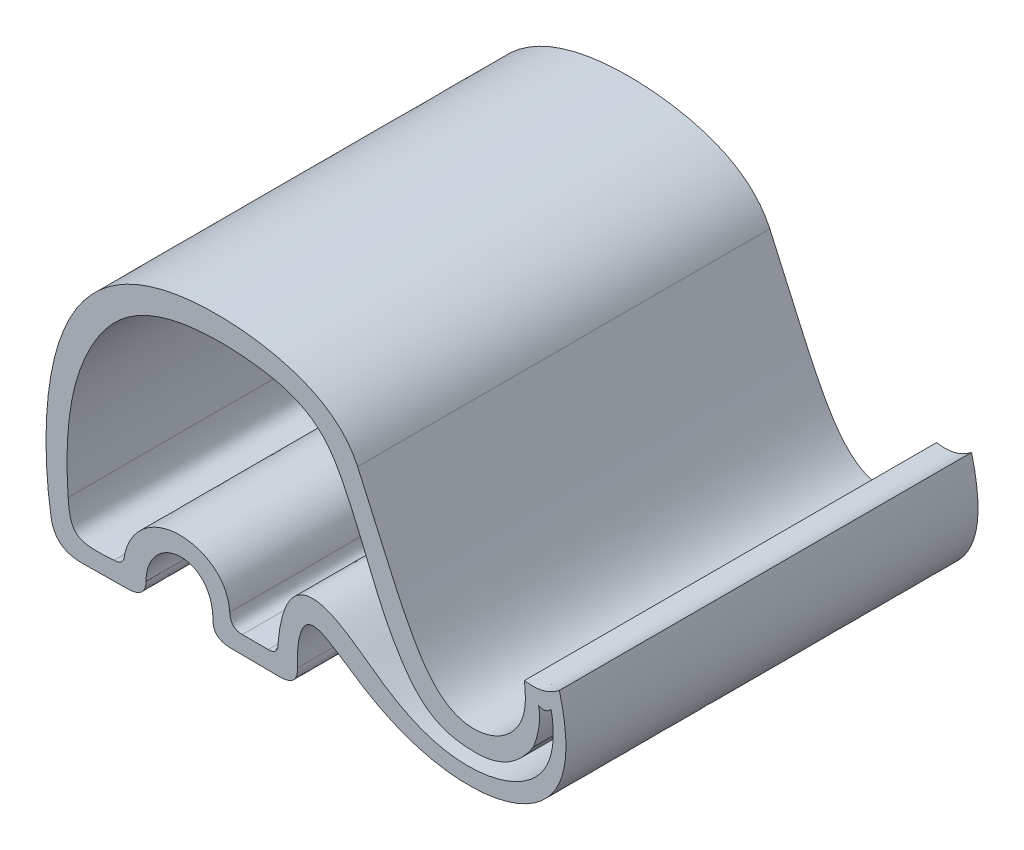
ISO-10303-21;
HEADER;
FILE_DESCRIPTION(('STEP AP214'),'2;1');
FILE_NAME('part.step','',(''),(''),'','','');
FILE_SCHEMA(('AUTOMOTIVE_DESIGN { 1 0 10303 214 1 1 1 1 }'));
ENDSEC;
DATA;
#1=APPLICATION_CONTEXT('core data for automotive mechanical design processes');
#2=APPLICATION_PROTOCOL_DEFINITION('international standard','automotive_design',2000,#1);
#3=PRODUCT_CONTEXT('',#1,'mechanical');
#4=PRODUCT('Part','Part','',(#3));
#5=PRODUCT_RELATED_PRODUCT_CATEGORY('part','',(#4));
#6=PRODUCT_DEFINITION_FORMATION('','',#4);
#7=PRODUCT_DEFINITION_CONTEXT('part definition',#1,'design');
#8=PRODUCT_DEFINITION('design','',#6,#7);
#9=PRODUCT_DEFINITION_SHAPE('','',#8);
#10=(LENGTH_UNIT() NAMED_UNIT(*) SI_UNIT(.MILLI.,.METRE.));
#11=(NAMED_UNIT(*) PLANE_ANGLE_UNIT() SI_UNIT($,.RADIAN.));
#12=(NAMED_UNIT(*) SI_UNIT($,.STERADIAN.) SOLID_ANGLE_UNIT());
#13=UNCERTAINTY_MEASURE_WITH_UNIT(LENGTH_MEASURE(1.E-05),#10,'distance_accuracy_value','');
#14=(GEOMETRIC_REPRESENTATION_CONTEXT(3) GLOBAL_UNCERTAINTY_ASSIGNED_CONTEXT((#13)) GLOBAL_UNIT_ASSIGNED_CONTEXT((#10,
#11,#12)) REPRESENTATION_CONTEXT('',''));
#15=CARTESIAN_POINT('',(0.,0.,0.));
#16=DIRECTION('',(0.,0.,1.));
#17=DIRECTION('',(1.,0.,0.));
#18=AXIS2_PLACEMENT_3D('',#15,#16,#17);
#19=CARTESIAN_POINT('',(-18.1297541734926,-1.68453041639156,60.));
#20=DIRECTION('',(0.,0.,-1.));
#21=DIRECTION('',(-1.,0.,0.));
#22=AXIS2_PLACEMENT_3D('',#19,#20,#21);
#23=PLANE('',#22);
#24=CARTESIAN_POINT('',(-18.7847093074648,0.025033472230253,60.));
#25=CARTESIAN_POINT('',(-18.8048831771839,-2.25438504593217,60.));
#26=CARTESIAN_POINT('',(-16.1245410321378,-2.25438504593217,60.));
#27=B_SPLINE_CURVE_WITH_KNOTS('',2,(#24,#25,#26),.UNSPECIFIED.,.F.,.F.,(3,3),(0.,1.),.UNSPECIFIED.);
#28=CARTESIAN_POINT('',(-18.7847093074648,0.025033472230253,60.));
#29=VERTEX_POINT('',#28);
#30=CARTESIAN_POINT('',(-16.1245410321378,-2.25438504593217,60.));
#31=VERTEX_POINT('',#30);
#32=EDGE_CURVE('E377',#29,#31,#27,.T.);
#33=ORIENTED_EDGE('',*,*,#32,.T.);
#34=DIRECTION('',(0.999963075438187,-0.00859347195278756,0.));
#35=VECTOR('',#34,1.);
#36=CARTESIAN_POINT('',(-16.1245410321378,-2.25438504593217,60.));
#37=LINE('',#36,#35);
#38=CARTESIAN_POINT('',(-9.13720622140498,-2.31443272888732,60.));
#39=VERTEX_POINT('',#38);
#40=EDGE_CURVE('E382',#31,#39,#37,.T.);
#41=ORIENTED_EDGE('',*,*,#40,.T.);
#42=CARTESIAN_POINT('',(-9.13720622140498,-2.31443272888732,60.));
#43=CARTESIAN_POINT('',(-6.35499691114976,-2.31443272888732,60.));
#44=CARTESIAN_POINT('',(-6.49510817137844,0.0874745893186231,60.));
#45=B_SPLINE_CURVE_WITH_KNOTS('',2,(#42,#43,#44),.UNSPECIFIED.,.F.,.F.,(3,3),(0.,1.),.UNSPECIFIED.);
#46=CARTESIAN_POINT('',(-6.49510817137844,0.0874745893186231,60.));
#47=VERTEX_POINT('',#46);
#48=EDGE_CURVE('E306',#39,#47,#45,.T.);
#49=ORIENTED_EDGE('',*,*,#48,.T.);
#50=CARTESIAN_POINT('',(-6.49510817137844,0.0874745893186231,60.));
#51=CARTESIAN_POINT('',(-6.72723372543326,7.79426015378786,60.));
#52=CARTESIAN_POINT('',(-4.30537033496014,9.55683443487067,60.));
#53=CARTESIAN_POINT('',(-1.85681080800865,8.18270365939022,60.));
#54=CARTESIAN_POINT('',(4.00268060893978,-2.09376082659216,60.));
#55=CARTESIAN_POINT('',(8.25644528516201,-4.78556569229704,60.));
#56=CARTESIAN_POINT('',(28.1896617064245,-6.26321452192812,60.));
#57=CARTESIAN_POINT('',(36.1608229452765,-1.24680260852348,60.));
#58=CARTESIAN_POINT('',(31.6514175632646,16.3395533054302,60.));
#59=B_SPLINE_CURVE_WITH_KNOTS('',8,(#50,#51,#52,#53,#54,#55,#56,#57,#58),.UNSPECIFIED.,.F.,.F.,
(9,9),(0.,1.),.UNSPECIFIED.);
#60=CARTESIAN_POINT('',(31.6514175632646,16.3395533054302,60.));
#61=VERTEX_POINT('',#60);
#62=EDGE_CURVE('E400',#47,#61,#59,.T.);
#63=ORIENTED_EDGE('',*,*,#62,.T.);
#64=CARTESIAN_POINT('',(31.6514175632646,16.3395533054302,60.));
#65=CARTESIAN_POINT('',(29.3835241252475,14.5408791994166,60.));
#66=CARTESIAN_POINT('',(26.5709547271854,15.0492001424205,60.));
#67=B_SPLINE_CURVE_WITH_KNOTS('',2,(#64,#65,#66),.UNSPECIFIED.,.F.,.F.,(3,3),(0.,1.),.UNSPECIFIED.);
#68=CARTESIAN_POINT('',(26.5709547271854,15.0492001424205,60.));
#69=VERTEX_POINT('',#68);
#70=EDGE_CURVE('E478',#61,#69,#67,.T.);
#71=ORIENTED_EDGE('',*,*,#70,.T.);
#72=CARTESIAN_POINT('',(26.5709547271854,15.0492001424205,60.));
#73=CARTESIAN_POINT('',(26.5709547271854,13.3569734216087,60.));
#74=CARTESIAN_POINT('',(27.5193951495443,10.3938462904723,60.));
#75=CARTESIAN_POINT('',(27.2732383145058,3.75339101211778,60.));
#76=CARTESIAN_POINT('',(17.938870985411,2.72399748377636,60.));
#77=CARTESIAN_POINT('',(12.7102260595019,3.67068189153078,60.));
#78=CARTESIAN_POINT('',(12.4464848708059,7.46392132549539,60.));
#79=CARTESIAN_POINT('',(2.27954642313074,29.8588258984784,60.));
#80=B_SPLINE_CURVE_WITH_KNOTS('',7,(#72,#73,#74,#75,#76,#77,#78,#79),.UNSPECIFIED.,.F.,.F.,(8,
8),(0.,1.),.UNSPECIFIED.);
#81=CARTESIAN_POINT('',(2.27954642313074,29.8588258984784,60.));
#82=VERTEX_POINT('',#81);
#83=EDGE_CURVE('E473',#69,#82,#80,.T.);
#84=ORIENTED_EDGE('',*,*,#83,.T.);
#85=CARTESIAN_POINT('',(2.27954642313074,29.8588258984784,60.));
#86=CARTESIAN_POINT('',(-2.55034539516275,40.3668261291284,60.));
#87=CARTESIAN_POINT('',(-16.5827857486711,39.2143749456407,60.));
#88=CARTESIAN_POINT('',(-24.8366252215099,40.440832656324,60.));
#89=CARTESIAN_POINT('',(-37.4297572223647,39.7507980261401,60.));
#90=CARTESIAN_POINT('',(-43.9850862091111,32.160417094118,60.));
#91=CARTESIAN_POINT('',(-44.1810862682469,12.3200787294162,60.));
#92=CARTESIAN_POINT('',(-42.3848689360867,1.43850497539512,60.));
#93=B_SPLINE_CURVE_WITH_KNOTS('',7,(#85,#86,#87,#88,#89,#90,#91,#92),.UNSPECIFIED.,.F.,.F.,(8,
8),(0.,1.),.UNSPECIFIED.);
#94=CARTESIAN_POINT('',(-42.3848689360867,1.43850497539512,60.));
#95=VERTEX_POINT('',#94);
#96=EDGE_CURVE('E451',#82,#95,#93,.T.);
#97=ORIENTED_EDGE('',*,*,#96,.T.);
#98=CARTESIAN_POINT('',(-42.3848689360867,1.43850497539512,60.));
#99=CARTESIAN_POINT('',(-41.9350741180409,-2.36206113870143,60.));
#100=CARTESIAN_POINT('',(-37.8701677236094,-2.36206113870143,60.));
#101=B_SPLINE_CURVE_WITH_KNOTS('',2,(#98,#99,#100),.UNSPECIFIED.,.F.,.F.,(3,3),(0.,1.),.UNSPECIFIED.);
#102=CARTESIAN_POINT('',(-37.8701677236094,-2.36206113870143,60.));
#103=VERTEX_POINT('',#102);
#104=EDGE_CURVE('E445',#95,#103,#101,.T.);
#105=ORIENTED_EDGE('',*,*,#104,.T.);
#106=DIRECTION('',(0.99993930020423,0.0110179810797571,0.));
#107=VECTOR('',#106,1.);
#108=CARTESIAN_POINT('',(-37.8701677236094,-2.36206113870143,60.));
#109=LINE('',#108,#107);
#110=CARTESIAN_POINT('',(-31.2920848975455,-2.28957954696497,60.));
#111=VERTEX_POINT('',#110);
#112=EDGE_CURVE('E439',#103,#111,#109,.T.);
#113=ORIENTED_EDGE('',*,*,#112,.T.);
#114=CARTESIAN_POINT('',(-31.2920848975455,-2.28957954696497,60.));
#115=CARTESIAN_POINT('',(-28.5839041330619,-2.3016734459421,60.));
#116=CARTESIAN_POINT('',(-28.5027158596157,0.0250334721873581,60.));
#117=B_SPLINE_CURVE_WITH_KNOTS('',2,(#114,#115,#116),.UNSPECIFIED.,.F.,.F.,(3,3),(0.,1.),.UNSPECIFIED.);
#118=CARTESIAN_POINT('',(-28.5027158596157,0.0250334721873581,60.));
#119=VERTEX_POINT('',#118);
#120=EDGE_CURVE('E430',#111,#119,#117,.T.);
#121=ORIENTED_EDGE('',*,*,#120,.T.);
#122=CARTESIAN_POINT('',(-28.5027158596157,0.0250334721873581,60.));
#123=CARTESIAN_POINT('',(-28.5035281304003,0.0253063789571861,60.));
#124=CARTESIAN_POINT('',(-29.0299720429813,6.01073130119566,60.));
#125=CARTESIAN_POINT('',(-24.0443593776686,7.08702638996528,60.));
#126=CARTESIAN_POINT('',(-20.7151082196556,6.54751959209084,60.));
#127=CARTESIAN_POINT('',(-18.8345781498626,3.87607070482394,60.));
#128=CARTESIAN_POINT('',(-18.7847093074648,0.025033472230253,60.));
#129=B_SPLINE_CURVE_WITH_KNOTS('',6,(#122,#123,#124,#125,#126,#127,#128),.UNSPECIFIED.,.F.,.F.,
(7,7),(0.,1.),.UNSPECIFIED.);
#130=EDGE_CURVE('E266',#119,#29,#129,.T.);
#131=ORIENTED_EDGE('',*,*,#130,.T.);
#132=EDGE_LOOP('',(#33,#41,#49,#63,#71,#84,#97,#105,#113,#121,#131));
#133=FACE_BOUND('',#132,.T.);
#134=CARTESIAN_POINT('',(-39.8633433420793,4.91544629700078,60.));
#135=CARTESIAN_POINT('',(-39.7384353496423,1.420627816904,60.));
#136=CARTESIAN_POINT('',(-38.7726447975183,0.781301676765599,60.));
#137=CARTESIAN_POINT('',(-38.3703683376246,0.397699779148166,60.));
#138=CARTESIAN_POINT('',(-36.9677710019108,-0.0370483140077449,60.));
#139=CARTESIAN_POINT('',(-33.1623861284738,0.345993029003945,60.));
#140=B_SPLINE_CURVE_WITH_KNOTS('',5,(#134,#135,#136,#137,#138,#139),.UNSPECIFIED.,.F.,.F.,(6,6),
(0.,1.),.UNSPECIFIED.);
#141=CARTESIAN_POINT('',(-39.8633433420793,4.91544629700078,60.));
#142=VERTEX_POINT('',#141);
#143=CARTESIAN_POINT('',(-33.1623861284738,0.345993029003945,60.));
#144=VERTEX_POINT('',#143);
#145=EDGE_CURVE('E184',#142,#144,#140,.T.);
#146=ORIENTED_EDGE('',*,*,#145,.F.);
#147=CARTESIAN_POINT('',(27.8560778192591,7.29140288896654,60.));
#148=CARTESIAN_POINT('',(25.6056802658863,3.81059925901845,60.));
#149=CARTESIAN_POINT('',(22.4450541070152,2.40625153185478,60.));
#150=CARTESIAN_POINT('',(17.0525106645951,2.37024332132425,60.));
#151=CARTESIAN_POINT('',(12.3221203391429,3.17845933394773,60.));
#152=CARTESIAN_POINT('',(7.11186355051298,10.8292700357513,60.));
#153=CARTESIAN_POINT('',(2.93304862444204,20.3605110149802,60.));
#154=CARTESIAN_POINT('',(-0.276148892102618,28.8048724957563,60.));
#155=CARTESIAN_POINT('',(-5.57094018583488,33.9364473003574,60.));
#156=CARTESIAN_POINT('',(-12.8493700722214,35.7048751446622,60.));
#157=CARTESIAN_POINT('',(-24.1392800174855,35.7290492578488,60.));
#158=CARTESIAN_POINT('',(-33.288801860584,31.694286548927,60.));
#159=CARTESIAN_POINT('',(-40.1871586294512,19.4872216189637,60.));
#160=CARTESIAN_POINT('',(-40.2013383317951,9.77162579850276,60.));
#161=CARTESIAN_POINT('',(-39.8633433420793,4.91544629700078,60.));
#162=B_SPLINE_CURVE_WITH_KNOTS('',3,(#147,#148,#149,#150,#151,#152,#153,#154,#155,#156,#157,
#158,#159,#160,#161),.UNSPECIFIED.,.F.,.F.,(4,1,1,1,1,1,1,1,1,1,1,1,4),(0.,0.0675261876122288,
0.0817356603650359,0.142094727528071,0.173477252161881,0.213936971443808,0.323719259612393,
0.348411043133253,0.460854806652413,0.586954776188091,0.706052673818982,0.812362495942945,1.),.UNSPECIFIED.);
#163=CARTESIAN_POINT('',(27.8560778192591,7.29140288896654,60.));
#164=VERTEX_POINT('',#163);
#165=EDGE_CURVE('E682',#164,#142,#162,.T.);
#166=ORIENTED_EDGE('',*,*,#165,.F.);
#167=CARTESIAN_POINT('',(28.6046312849192,12.92466157004,60.));
#168=CARTESIAN_POINT('',(28.9113255295663,11.8785185981307,60.));
#169=CARTESIAN_POINT('',(28.8914869425778,9.9923592917523,60.));
#170=CARTESIAN_POINT('',(27.856077819259,7.29140288896642,60.));
#171=B_SPLINE_CURVE_WITH_KNOTS('',3,(#167,#168,#169,#170),.UNSPECIFIED.,.F.,.F.,(4,4),(0.,1.),.UNSPECIFIED.);
#172=CARTESIAN_POINT('',(28.6046312849192,12.92466157004,60.));
#173=VERTEX_POINT('',#172);
#174=EDGE_CURVE('E688',#173,#164,#171,.T.);
#175=ORIENTED_EDGE('',*,*,#174,.F.);
#176=CARTESIAN_POINT('',(30.4392676222554,13.3569734216087,60.));
#177=CARTESIAN_POINT('',(29.6742811934181,12.4069404229043,60.));
#178=CARTESIAN_POINT('',(28.6046312849192,12.92466157004,60.));
#179=B_SPLINE_CURVE_WITH_KNOTS('',2,(#176,#177,#178),.UNSPECIFIED.,.F.,.F.,(3,3),(0.,1.),.UNSPECIFIED.);
#180=CARTESIAN_POINT('',(30.4392676222554,13.3569734216087,60.));
#181=VERTEX_POINT('',#180);
#182=EDGE_CURVE('E805',#181,#173,#179,.T.);
#183=ORIENTED_EDGE('',*,*,#182,.F.);
#184=CARTESIAN_POINT('',(-9.29300105561001,1.89826092896259,60.));
#185=CARTESIAN_POINT('',(-9.07155049822039,4.66823358767532,60.));
#186=CARTESIAN_POINT('',(-8.60838454863201,6.31111913420722,60.));
#187=CARTESIAN_POINT('',(-7.87672485307844,10.2469340531362,60.));
#188=CARTESIAN_POINT('',(-6.12503309978417,11.5148389621331,60.));
#189=CARTESIAN_POINT('',(-4.7248261426156,13.2523810579135,60.));
#190=CARTESIAN_POINT('',(1.11662821361413,11.538873103432,60.));
#191=CARTESIAN_POINT('',(5.87460045359611,5.99613340565192,60.));
#192=CARTESIAN_POINT('',(5.29823091099882,-0.210652764812113,60.));
#193=CARTESIAN_POINT('',(8.94813075450834,-1.89591269747759,60.));
#194=CARTESIAN_POINT('',(20.6238039031241,-4.10150901676976,60.));
#195=CARTESIAN_POINT('',(29.6197905104313,-0.447897883656895,60.));
#196=CARTESIAN_POINT('',(30.1655563452534,3.59242811933387,60.));
#197=CARTESIAN_POINT('',(31.573214341264,8.28462143936933,60.));
#198=CARTESIAN_POINT('',(30.4392676222554,13.3569734216087,60.));
#199=B_SPLINE_CURVE_WITH_KNOTS('',14,(#184,#185,#186,#187,#188,#189,#190,#191,#192,#193,#194,
#195,#196,#197,#198),.UNSPECIFIED.,.F.,.F.,(15,15),(0.,1.),.UNSPECIFIED.);
#200=CARTESIAN_POINT('',(-9.29300105561001,1.89826092896259,60.));
#201=VERTEX_POINT('',#200);
#202=EDGE_CURVE('E809',#201,#181,#199,.T.);
#203=ORIENTED_EDGE('',*,*,#202,.F.);
#204=CARTESIAN_POINT('',(-10.7385645410521,0.296826767368485,60.));
#205=CARTESIAN_POINT('',(-9.26271249145846,0.266184780041518,60.));
#206=CARTESIAN_POINT('',(-9.29300105561001,1.89826092896259,60.));
#207=B_SPLINE_CURVE_WITH_KNOTS('',2,(#204,#205,#206),.UNSPECIFIED.,.F.,.F.,(3,3),(0.,1.),.UNSPECIFIED.);
#208=CARTESIAN_POINT('',(-10.7385645410521,0.296826767368485,60.));
#209=VERTEX_POINT('',#208);
#210=EDGE_CURVE('E812',#209,#201,#207,.T.);
#211=ORIENTED_EDGE('',*,*,#210,.F.);
#212=DIRECTION('',(1.,0.,0.));
#213=VECTOR('',#212,1.);
#214=CARTESIAN_POINT('',(-14.5104683109225,0.296826767368485,60.));
#215=LINE('',#214,#213);
#216=CARTESIAN_POINT('',(-14.5104683109225,0.296826767368485,60.));
#217=VERTEX_POINT('',#216);
#218=EDGE_CURVE('E829',#217,#209,#215,.T.);
#219=ORIENTED_EDGE('',*,*,#218,.F.);
#220=CARTESIAN_POINT('',(-16.3446685038147,2.19923724161591,60.));
#221=CARTESIAN_POINT('',(-16.226273329023,0.286962920137912,60.));
#222=CARTESIAN_POINT('',(-14.5104683109225,0.296826767368485,60.));
#223=B_SPLINE_CURVE_WITH_KNOTS('',2,(#220,#221,#222),.UNSPECIFIED.,.F.,.F.,(3,3),(0.,1.),.UNSPECIFIED.);
#224=CARTESIAN_POINT('',(-16.3446685038147,2.19923724161591,60.));
#225=VERTEX_POINT('',#224);
#226=EDGE_CURVE('E211',#225,#217,#223,.T.);
#227=ORIENTED_EDGE('',*,*,#226,.F.);
#228=CARTESIAN_POINT('',(-31.6471540702569,1.9177995715692,60.));
#229=CARTESIAN_POINT('',(-30.0566210515396,8.06288287383961,60.));
#230=CARTESIAN_POINT('',(-24.4550019118859,10.4628641969819,60.));
#231=CARTESIAN_POINT('',(-18.2271733326345,8.51850232927837,60.));
#232=CARTESIAN_POINT('',(-16.6176199929895,5.43172208944781,60.));
#233=CARTESIAN_POINT('',(-16.3446685038147,2.19923724161591,60.));
#234=B_SPLINE_CURVE_WITH_KNOTS('',5,(#228,#229,#230,#231,#232,#233),.UNSPECIFIED.,.F.,.F.,(6,6),
(0.,1.),.UNSPECIFIED.);
#235=CARTESIAN_POINT('',(-31.6471540702569,1.9177995715692,60.));
#236=VERTEX_POINT('',#235);
#237=EDGE_CURVE('E207',#236,#225,#234,.T.);
#238=ORIENTED_EDGE('',*,*,#237,.F.);
#239=CARTESIAN_POINT('',(-33.1623861284738,0.345993029003945,60.));
#240=CARTESIAN_POINT('',(-31.6940141905696,0.343791118965749,60.));
#241=CARTESIAN_POINT('',(-31.6471540702569,1.9177995715692,60.));
#242=B_SPLINE_CURVE_WITH_KNOTS('',2,(#239,#240,#241),.UNSPECIFIED.,.F.,.F.,(3,3),(0.,1.),.UNSPECIFIED.);
#243=EDGE_CURVE('E193',#144,#236,#242,.T.);
#244=ORIENTED_EDGE('',*,*,#243,.F.);
#245=EDGE_LOOP('',(#146,#166,#175,#183,#203,#211,#219,#227,#238,#244));
#246=FACE_BOUND('',#245,.T.);
#247=ADVANCED_FACE('F39',(#133,#246),#23,.F.);
#248=CARTESIAN_POINT('',(-18.1297541734926,-1.68453041639156,0.));
#249=DIRECTION('',(0.,0.,-1.));
#250=DIRECTION('',(-1.,0.,0.));
#251=AXIS2_PLACEMENT_3D('',#248,#249,#250);
#252=PLANE('',#251);
#253=CARTESIAN_POINT('',(-18.7847093074648,0.025033472230253,0.));
#254=CARTESIAN_POINT('',(-18.8048831771839,-2.25438504593217,0.));
#255=CARTESIAN_POINT('',(-16.1245410321378,-2.25438504593217,0.));
#256=B_SPLINE_CURVE_WITH_KNOTS('',2,(#253,#254,#255),.UNSPECIFIED.,.F.,.F.,(3,3),(0.,1.),.UNSPECIFIED.);
#257=CARTESIAN_POINT('',(-18.7847093074648,0.025033472230253,0.));
#258=VERTEX_POINT('',#257);
#259=CARTESIAN_POINT('',(-16.1245410321378,-2.25438504593217,0.));
#260=VERTEX_POINT('',#259);
#261=EDGE_CURVE('E202',#258,#260,#256,.T.);
#262=ORIENTED_EDGE('',*,*,#261,.F.);
#263=CARTESIAN_POINT('',(-28.5027158596157,0.0250334721873581,0.));
#264=CARTESIAN_POINT('',(-28.5035281304003,0.0253063789571861,0.));
#265=CARTESIAN_POINT('',(-29.0299720429813,6.01073130119566,0.));
#266=CARTESIAN_POINT('',(-24.0443593776686,7.08702638996528,0.));
#267=CARTESIAN_POINT('',(-20.7151082196556,6.54751959209084,0.));
#268=CARTESIAN_POINT('',(-18.8345781498626,3.87607070482394,0.));
#269=CARTESIAN_POINT('',(-18.7847093074648,0.025033472230253,0.));
#270=B_SPLINE_CURVE_WITH_KNOTS('',6,(#263,#264,#265,#266,#267,#268,#269),.UNSPECIFIED.,.F.,.F.,
(7,7),(0.,1.),.UNSPECIFIED.);
#271=CARTESIAN_POINT('',(-28.5027158596157,0.0250334721873581,0.));
#272=VERTEX_POINT('',#271);
#273=EDGE_CURVE('E254',#272,#258,#270,.T.);
#274=ORIENTED_EDGE('',*,*,#273,.F.);
#275=CARTESIAN_POINT('',(-31.2920848975455,-2.28957954696497,0.));
#276=CARTESIAN_POINT('',(-28.5839041330619,-2.3016734459421,0.));
#277=CARTESIAN_POINT('',(-28.5027158596157,0.0250334721873581,0.));
#278=B_SPLINE_CURVE_WITH_KNOTS('',2,(#275,#276,#277),.UNSPECIFIED.,.F.,.F.,(3,3),(0.,1.),.UNSPECIFIED.);
#279=CARTESIAN_POINT('',(-31.2920848975455,-2.28957954696497,0.));
#280=VERTEX_POINT('',#279);
#281=EDGE_CURVE('E366',#280,#272,#278,.T.);
#282=ORIENTED_EDGE('',*,*,#281,.F.);
#283=DIRECTION('',(0.99993930020423,0.0110179810797571,0.));
#284=VECTOR('',#283,1.);
#285=CARTESIAN_POINT('',(-37.8701677236094,-2.36206113870143,0.));
#286=LINE('',#285,#284);
#287=CARTESIAN_POINT('',(-37.8701677236094,-2.36206113870143,0.));
#288=VERTEX_POINT('',#287);
#289=EDGE_CURVE('E361',#288,#280,#286,.T.);
#290=ORIENTED_EDGE('',*,*,#289,.F.);
#291=CARTESIAN_POINT('',(-42.3848689360867,1.43850497539512,0.));
#292=CARTESIAN_POINT('',(-41.9350741180409,-2.36206113870143,0.));
#293=CARTESIAN_POINT('',(-37.8701677236094,-2.36206113870143,0.));
#294=B_SPLINE_CURVE_WITH_KNOTS('',2,(#291,#292,#293),.UNSPECIFIED.,.F.,.F.,(3,3),(0.,1.),.UNSPECIFIED.);
#295=CARTESIAN_POINT('',(-42.3848689360867,1.43850497539512,0.));
#296=VERTEX_POINT('',#295);
#297=EDGE_CURVE('E353',#296,#288,#294,.T.);
#298=ORIENTED_EDGE('',*,*,#297,.F.);
#299=CARTESIAN_POINT('',(2.27954642313074,29.8588258984784,0.));
#300=CARTESIAN_POINT('',(-2.55034539516275,40.3668261291284,0.));
#301=CARTESIAN_POINT('',(-16.5827857486711,39.2143749456407,0.));
#302=CARTESIAN_POINT('',(-24.8366252215099,40.440832656324,0.));
#303=CARTESIAN_POINT('',(-37.4297572223647,39.7507980261401,0.));
#304=CARTESIAN_POINT('',(-43.9850862091111,32.160417094118,0.));
#305=CARTESIAN_POINT('',(-44.1810862682469,12.3200787294162,0.));
#306=CARTESIAN_POINT('',(-42.3848689360867,1.43850497539512,0.));
#307=B_SPLINE_CURVE_WITH_KNOTS('',7,(#299,#300,#301,#302,#303,#304,#305,#306),.UNSPECIFIED.,.F.,
.F.,(8,8),(0.,1.),.UNSPECIFIED.);
#308=CARTESIAN_POINT('',(2.27954642313074,29.8588258984784,0.));
#309=VERTEX_POINT('',#308);
#310=EDGE_CURVE('E345',#309,#296,#307,.T.);
#311=ORIENTED_EDGE('',*,*,#310,.F.);
#312=CARTESIAN_POINT('',(26.5709547271854,15.0492001424205,0.));
#313=CARTESIAN_POINT('',(26.5709547271854,13.3569734216087,0.));
#314=CARTESIAN_POINT('',(27.5193951495443,10.3938462904723,0.));
#315=CARTESIAN_POINT('',(27.2732383145058,3.75339101211778,0.));
#316=CARTESIAN_POINT('',(17.938870985411,2.72399748377636,0.));
#317=CARTESIAN_POINT('',(12.7102260595019,3.67068189153078,0.));
#318=CARTESIAN_POINT('',(12.4464848708059,7.46392132549539,0.));
#319=CARTESIAN_POINT('',(2.27954642313074,29.8588258984784,0.));
#320=B_SPLINE_CURVE_WITH_KNOTS('',7,(#312,#313,#314,#315,#316,#317,#318,#319),.UNSPECIFIED.,.F.,
.F.,(8,8),(0.,1.),.UNSPECIFIED.);
#321=CARTESIAN_POINT('',(26.5709547271854,15.0492001424205,0.));
#322=VERTEX_POINT('',#321);
#323=EDGE_CURVE('E337',#322,#309,#320,.T.);
#324=ORIENTED_EDGE('',*,*,#323,.F.);
#325=CARTESIAN_POINT('',(31.6514175632646,16.3395533054302,0.));
#326=CARTESIAN_POINT('',(29.3835241252475,14.5408791994166,0.));
#327=CARTESIAN_POINT('',(26.5709547271854,15.0492001424205,0.));
#328=B_SPLINE_CURVE_WITH_KNOTS('',2,(#325,#326,#327),.UNSPECIFIED.,.F.,.F.,(3,3),(0.,1.),.UNSPECIFIED.);
#329=CARTESIAN_POINT('',(31.6514175632646,16.3395533054302,0.));
#330=VERTEX_POINT('',#329);
#331=EDGE_CURVE('E318',#330,#322,#328,.T.);
#332=ORIENTED_EDGE('',*,*,#331,.F.);
#333=CARTESIAN_POINT('',(-6.49510817137844,0.0874745893186231,0.));
#334=CARTESIAN_POINT('',(-6.72723372543326,7.79426015378786,0.));
#335=CARTESIAN_POINT('',(-4.30537033496014,9.55683443487067,0.));
#336=CARTESIAN_POINT('',(-1.85681080800865,8.18270365939022,0.));
#337=CARTESIAN_POINT('',(4.00268060893978,-2.09376082659216,0.));
#338=CARTESIAN_POINT('',(8.25644528516201,-4.78556569229704,0.));
#339=CARTESIAN_POINT('',(28.1896617064245,-6.26321452192812,0.));
#340=CARTESIAN_POINT('',(36.1608229452765,-1.24680260852348,0.));
#341=CARTESIAN_POINT('',(31.6514175632646,16.3395533054302,0.));
#342=B_SPLINE_CURVE_WITH_KNOTS('',8,(#333,#334,#335,#336,#337,#338,#339,#340,#341),
.UNSPECIFIED.,.F.,.F.,(9,9),(0.,1.),.UNSPECIFIED.);
#343=CARTESIAN_POINT('',(-6.49510817137844,0.0874745893186231,0.));
#344=VERTEX_POINT('',#343);
#345=EDGE_CURVE('E313',#344,#330,#342,.T.);
#346=ORIENTED_EDGE('',*,*,#345,.F.);
#347=CARTESIAN_POINT('',(-9.13720622140498,-2.31443272888732,0.));
#348=CARTESIAN_POINT('',(-6.35499691114976,-2.31443272888732,0.));
#349=CARTESIAN_POINT('',(-6.49510817137844,0.0874745893186231,0.));
#350=B_SPLINE_CURVE_WITH_KNOTS('',2,(#347,#348,#349),.UNSPECIFIED.,.F.,.F.,(3,3),(0.,1.),.UNSPECIFIED.);
#351=CARTESIAN_POINT('',(-9.13720622140498,-2.31443272888732,0.));
#352=VERTEX_POINT('',#351);
#353=EDGE_CURVE('E305',#352,#344,#350,.T.);
#354=ORIENTED_EDGE('',*,*,#353,.F.);
#355=DIRECTION('',(0.999963075438187,-0.00859347195278756,0.));
#356=VECTOR('',#355,1.);
#357=CARTESIAN_POINT('',(-16.1245410321378,-2.25438504593217,0.));
#358=LINE('',#357,#356);
#359=EDGE_CURVE('E311',#260,#352,#358,.T.);
#360=ORIENTED_EDGE('',*,*,#359,.F.);
#361=EDGE_LOOP('',(#262,#274,#282,#290,#298,#311,#324,#332,#346,#354,#360));
#362=FACE_BOUND('',#361,.T.);
#363=CARTESIAN_POINT('',(27.8560778192591,7.29140288896654,0.));
#364=CARTESIAN_POINT('',(25.6056802658863,3.81059925901845,0.));
#365=CARTESIAN_POINT('',(22.4450541070152,2.40625153185478,0.));
#366=CARTESIAN_POINT('',(17.0525106645951,2.37024332132425,0.));
#367=CARTESIAN_POINT('',(12.3221203391429,3.17845933394773,0.));
#368=CARTESIAN_POINT('',(7.11186355051298,10.8292700357513,0.));
#369=CARTESIAN_POINT('',(2.93304862444204,20.3605110149802,0.));
#370=CARTESIAN_POINT('',(-0.276148892102618,28.8048724957563,0.));
#371=CARTESIAN_POINT('',(-5.57094018583488,33.9364473003574,0.));
#372=CARTESIAN_POINT('',(-12.8493700722214,35.7048751446622,0.));
#373=CARTESIAN_POINT('',(-24.1392800174855,35.7290492578488,0.));
#374=CARTESIAN_POINT('',(-33.288801860584,31.694286548927,0.));
#375=CARTESIAN_POINT('',(-40.1871586294512,19.4872216189637,0.));
#376=CARTESIAN_POINT('',(-40.2013383317951,9.77162579850276,0.));
#377=CARTESIAN_POINT('',(-39.8633433420793,4.91544629700078,0.));
#378=B_SPLINE_CURVE_WITH_KNOTS('',3,(#363,#364,#365,#366,#367,#368,#369,#370,#371,#372,#373,
#374,#375,#376,#377),.UNSPECIFIED.,.F.,.F.,(4,1,1,1,1,1,1,1,1,1,1,1,4),(0.,0.0675261876122288,
0.0817356603650359,0.142094727528071,0.173477252161881,0.213936971443808,0.323719259612393,
0.348411043133253,0.460854806652413,0.586954776188091,0.706052673818982,0.812362495942945,1.),.UNSPECIFIED.);
#379=CARTESIAN_POINT('',(27.8560778192591,7.29140288896654,0.));
#380=VERTEX_POINT('',#379);
#381=CARTESIAN_POINT('',(-39.8633433420793,4.91544629700078,0.));
#382=VERTEX_POINT('',#381);
#383=EDGE_CURVE('E194',#380,#382,#378,.T.);
#384=ORIENTED_EDGE('',*,*,#383,.T.);
#385=CARTESIAN_POINT('',(-39.8633433420793,4.91544629700078,0.));
#386=CARTESIAN_POINT('',(-39.7384353496423,1.420627816904,0.));
#387=CARTESIAN_POINT('',(-38.7726447975183,0.781301676765599,0.));
#388=CARTESIAN_POINT('',(-38.3703683376246,0.397699779148166,0.));
#389=CARTESIAN_POINT('',(-36.9677710019108,-0.0370483140077449,0.));
#390=CARTESIAN_POINT('',(-33.1623861284738,0.345993029003945,0.));
#391=B_SPLINE_CURVE_WITH_KNOTS('',5,(#385,#386,#387,#388,#389,#390),.UNSPECIFIED.,.F.,.F.,(6,6),
(0.,1.),.UNSPECIFIED.);
#392=CARTESIAN_POINT('',(-33.1623861284738,0.345993029003945,0.));
#393=VERTEX_POINT('',#392);
#394=EDGE_CURVE('E64',#382,#393,#391,.T.);
#395=ORIENTED_EDGE('',*,*,#394,.T.);
#396=CARTESIAN_POINT('',(-33.1623861284738,0.345993029003945,0.));
#397=CARTESIAN_POINT('',(-31.6940141905696,0.343791118965749,0.));
#398=CARTESIAN_POINT('',(-31.6471540702569,1.9177995715692,0.));
#399=B_SPLINE_CURVE_WITH_KNOTS('',2,(#396,#397,#398),.UNSPECIFIED.,.F.,.F.,(3,3),(0.,1.),.UNSPECIFIED.);
#400=CARTESIAN_POINT('',(-31.6471540702569,1.9177995715692,0.));
#401=VERTEX_POINT('',#400);
#402=EDGE_CURVE('E200',#393,#401,#399,.T.);
#403=ORIENTED_EDGE('',*,*,#402,.T.);
#404=CARTESIAN_POINT('',(-31.6471540702569,1.9177995715692,0.));
#405=CARTESIAN_POINT('',(-30.0566210515396,8.06288287383961,0.));
#406=CARTESIAN_POINT('',(-24.4550019118859,10.4628641969819,0.));
#407=CARTESIAN_POINT('',(-18.2271733326345,8.51850232927837,0.));
#408=CARTESIAN_POINT('',(-16.6176199929895,5.43172208944781,0.));
#409=CARTESIAN_POINT('',(-16.3446685038147,2.19923724161591,0.));
#410=B_SPLINE_CURVE_WITH_KNOTS('',5,(#404,#405,#406,#407,#408,#409),.UNSPECIFIED.,.F.,.F.,(6,6),
(0.,1.),.UNSPECIFIED.);
#411=CARTESIAN_POINT('',(-16.3446685038147,2.19923724161591,0.));
#412=VERTEX_POINT('',#411);
#413=EDGE_CURVE('E707',#401,#412,#410,.T.);
#414=ORIENTED_EDGE('',*,*,#413,.T.);
#415=CARTESIAN_POINT('',(-16.3446685038147,2.19923724161591,0.));
#416=CARTESIAN_POINT('',(-16.226273329023,0.286962920137912,0.));
#417=CARTESIAN_POINT('',(-14.5104683109225,0.296826767368485,0.));
#418=B_SPLINE_CURVE_WITH_KNOTS('',2,(#415,#416,#417),.UNSPECIFIED.,.F.,.F.,(3,3),(0.,1.),.UNSPECIFIED.);
#419=CARTESIAN_POINT('',(-14.5104683109225,0.296826767368485,0.));
#420=VERTEX_POINT('',#419);
#421=EDGE_CURVE('E716',#412,#420,#418,.T.);
#422=ORIENTED_EDGE('',*,*,#421,.T.);
#423=DIRECTION('',(1.,0.,0.));
#424=VECTOR('',#423,1.);
#425=CARTESIAN_POINT('',(-14.5104683109225,0.296826767368485,0.));
#426=LINE('',#425,#424);
#427=CARTESIAN_POINT('',(-10.7385645410521,0.296826767368485,0.));
#428=VERTEX_POINT('',#427);
#429=EDGE_CURVE('E725',#420,#428,#426,.T.);
#430=ORIENTED_EDGE('',*,*,#429,.T.);
#431=CARTESIAN_POINT('',(-10.7385645410521,0.296826767368485,0.));
#432=CARTESIAN_POINT('',(-9.26271249145846,0.266184780041518,0.));
#433=CARTESIAN_POINT('',(-9.29300105561001,1.89826092896259,0.));
#434=B_SPLINE_CURVE_WITH_KNOTS('',2,(#431,#432,#433),.UNSPECIFIED.,.F.,.F.,(3,3),(0.,1.),.UNSPECIFIED.);
#435=CARTESIAN_POINT('',(-9.29300105561001,1.89826092896259,0.));
#436=VERTEX_POINT('',#435);
#437=EDGE_CURVE('E732',#428,#436,#434,.T.);
#438=ORIENTED_EDGE('',*,*,#437,.T.);
#439=CARTESIAN_POINT('',(-9.29300105561001,1.89826092896259,0.));
#440=CARTESIAN_POINT('',(-9.07155049822039,4.66823358767532,0.));
#441=CARTESIAN_POINT('',(-8.60838454863201,6.31111913420722,0.));
#442=CARTESIAN_POINT('',(-7.87672485307844,10.2469340531362,0.));
#443=CARTESIAN_POINT('',(-6.12503309978417,11.5148389621331,0.));
#444=CARTESIAN_POINT('',(-4.7248261426156,13.2523810579135,0.));
#445=CARTESIAN_POINT('',(1.11662821361413,11.538873103432,0.));
#446=CARTESIAN_POINT('',(5.87460045359611,5.99613340565192,0.));
#447=CARTESIAN_POINT('',(5.29823091099882,-0.210652764812113,0.));
#448=CARTESIAN_POINT('',(8.94813075450834,-1.89591269747759,0.));
#449=CARTESIAN_POINT('',(20.6238039031241,-4.10150901676976,0.));
#450=CARTESIAN_POINT('',(29.6197905104313,-0.447897883656895,0.));
#451=CARTESIAN_POINT('',(30.1655563452534,3.59242811933387,0.));
#452=CARTESIAN_POINT('',(31.573214341264,8.28462143936933,0.));
#453=CARTESIAN_POINT('',(30.4392676222554,13.3569734216087,0.));
#454=B_SPLINE_CURVE_WITH_KNOTS('',14,(#439,#440,#441,#442,#443,#444,#445,#446,#447,#448,#449,
#450,#451,#452,#453),.UNSPECIFIED.,.F.,.F.,(15,15),(0.,1.),.UNSPECIFIED.);
#455=CARTESIAN_POINT('',(30.4392676222554,13.3569734216087,0.));
#456=VERTEX_POINT('',#455);
#457=EDGE_CURVE('E738',#436,#456,#454,.T.);
#458=ORIENTED_EDGE('',*,*,#457,.T.);
#459=CARTESIAN_POINT('',(30.4392676222554,13.3569734216087,0.));
#460=CARTESIAN_POINT('',(29.6742811934181,12.4069404229043,0.));
#461=CARTESIAN_POINT('',(28.6046312849192,12.92466157004,0.));
#462=B_SPLINE_CURVE_WITH_KNOTS('',2,(#459,#460,#461),.UNSPECIFIED.,.F.,.F.,(3,3),(0.,1.),.UNSPECIFIED.);
#463=CARTESIAN_POINT('',(28.6046312849192,12.92466157004,0.));
#464=VERTEX_POINT('',#463);
#465=EDGE_CURVE('E747',#456,#464,#462,.T.);
#466=ORIENTED_EDGE('',*,*,#465,.T.);
#467=CARTESIAN_POINT('',(28.6046312849192,12.92466157004,0.));
#468=CARTESIAN_POINT('',(28.9113255295663,11.8785185981307,0.));
#469=CARTESIAN_POINT('',(28.8914869425778,9.9923592917523,0.));
#470=CARTESIAN_POINT('',(27.856077819259,7.29140288896642,0.));
#471=B_SPLINE_CURVE_WITH_KNOTS('',3,(#467,#468,#469,#470),.UNSPECIFIED.,.F.,.F.,(4,4),(0.,1.),.UNSPECIFIED.);
#472=EDGE_CURVE('E756',#464,#380,#471,.T.);
#473=ORIENTED_EDGE('',*,*,#472,.T.);
#474=EDGE_LOOP('',(#384,#395,#403,#414,#422,#430,#438,#458,#466,#473));
#475=FACE_BOUND('',#474,.T.);
#476=ADVANCED_FACE('F237',(#362,#475),#252,.T.);
#477=DIRECTION('',(0.,0.,-1.));
#478=VECTOR('',#477,1.);
#479=SURFACE_OF_LINEAR_EXTRUSION('',#27,#478);
#480=ORIENTED_EDGE('',*,*,#261,.T.);
#481=DIRECTION('',(0.,0.,-1.));
#482=VECTOR('',#481,1.);
#483=CARTESIAN_POINT('',(-16.1245410321378,-2.25438504593217,60.));
#484=LINE('',#483,#482);
#485=EDGE_CURVE('E11',#31,#260,#484,.T.);
#486=ORIENTED_EDGE('',*,*,#485,.F.);
#487=ORIENTED_EDGE('',*,*,#32,.F.);
#488=DIRECTION('',(0.,0.,-1.));
#489=VECTOR('',#488,1.);
#490=CARTESIAN_POINT('',(-18.7847093074648,0.025033472230253,60.));
#491=LINE('',#490,#489);
#492=EDGE_CURVE('E258',#29,#258,#491,.T.);
#493=ORIENTED_EDGE('',*,*,#492,.T.);
#494=EDGE_LOOP('',(#480,#486,#487,#493));
#495=FACE_BOUND('',#494,.T.);
#496=ADVANCED_FACE('F41',(#495),#479,.F.);
#497=CARTESIAN_POINT('',(-16.1245410321378,-2.25438504593217,60.));
#498=DIRECTION('',(0.00859347195278756,0.999963075438187,0.));
#499=DIRECTION('',(-0.999963075438187,0.00859347195278756,0.));
#500=AXIS2_PLACEMENT_3D('',#497,#498,#499);
#501=PLANE('',#500);
#502=ORIENTED_EDGE('',*,*,#359,.T.);
#503=DIRECTION('',(0.,0.,-1.));
#504=VECTOR('',#503,1.);
#505=CARTESIAN_POINT('',(-9.13720622140498,-2.31443272888732,60.));
#506=LINE('',#505,#504);
#507=EDGE_CURVE('E49',#39,#352,#506,.T.);
#508=ORIENTED_EDGE('',*,*,#507,.F.);
#509=ORIENTED_EDGE('',*,*,#40,.F.);
#510=ORIENTED_EDGE('',*,*,#485,.T.);
#511=EDGE_LOOP('',(#502,#508,#509,#510));
#512=FACE_BOUND('',#511,.T.);
#513=ADVANCED_FACE('F412',(#512),#501,.F.);
#514=DIRECTION('',(0.,0.,-1.));
#515=VECTOR('',#514,1.);
#516=SURFACE_OF_LINEAR_EXTRUSION('',#45,#515);
#517=ORIENTED_EDGE('',*,*,#353,.T.);
#518=DIRECTION('',(0.,0.,-1.));
#519=VECTOR('',#518,1.);
#520=CARTESIAN_POINT('',(-6.49510817137844,0.0874745893186231,60.));
#521=LINE('',#520,#519);
#522=EDGE_CURVE('E294',#47,#344,#521,.T.);
#523=ORIENTED_EDGE('',*,*,#522,.F.);
#524=ORIENTED_EDGE('',*,*,#48,.F.);
#525=ORIENTED_EDGE('',*,*,#507,.T.);
#526=EDGE_LOOP('',(#517,#523,#524,#525));
#527=FACE_BOUND('',#526,.T.);
#528=ADVANCED_FACE('F303',(#527),#516,.F.);
#529=DIRECTION('',(0.,0.,-1.));
#530=VECTOR('',#529,1.);
#531=SURFACE_OF_LINEAR_EXTRUSION('',#59,#530);
#532=ORIENTED_EDGE('',*,*,#345,.T.);
#533=DIRECTION('',(0.,0.,-1.));
#534=VECTOR('',#533,1.);
#535=CARTESIAN_POINT('',(31.6514175632646,16.3395533054302,60.));
#536=LINE('',#535,#534);
#537=EDGE_CURVE('E290',#61,#330,#536,.T.);
#538=ORIENTED_EDGE('',*,*,#537,.F.);
#539=ORIENTED_EDGE('',*,*,#62,.F.);
#540=ORIENTED_EDGE('',*,*,#522,.T.);
#541=EDGE_LOOP('',(#532,#538,#539,#540));
#542=FACE_BOUND('',#541,.T.);
#543=ADVANCED_FACE('F411',(#542),#531,.F.);
#544=DIRECTION('',(0.,0.,-1.));
#545=VECTOR('',#544,1.);
#546=SURFACE_OF_LINEAR_EXTRUSION('',#67,#545);
#547=ORIENTED_EDGE('',*,*,#331,.T.);
#548=DIRECTION('',(0.,0.,-1.));
#549=VECTOR('',#548,1.);
#550=CARTESIAN_POINT('',(26.5709547271854,15.0492001424205,60.));
#551=LINE('',#550,#549);
#552=EDGE_CURVE('E286',#69,#322,#551,.T.);
#553=ORIENTED_EDGE('',*,*,#552,.F.);
#554=ORIENTED_EDGE('',*,*,#70,.F.);
#555=ORIENTED_EDGE('',*,*,#537,.T.);
#556=EDGE_LOOP('',(#547,#553,#554,#555));
#557=FACE_BOUND('',#556,.T.);
#558=ADVANCED_FACE('F471',(#557),#546,.F.);
#559=DIRECTION('',(0.,0.,-1.));
#560=VECTOR('',#559,1.);
#561=SURFACE_OF_LINEAR_EXTRUSION('',#80,#560);
#562=ORIENTED_EDGE('',*,*,#323,.T.);
#563=DIRECTION('',(0.,0.,-1.));
#564=VECTOR('',#563,1.);
#565=CARTESIAN_POINT('',(2.27954642313074,29.8588258984784,60.));
#566=LINE('',#565,#564);
#567=EDGE_CURVE('E282',#82,#309,#566,.T.);
#568=ORIENTED_EDGE('',*,*,#567,.F.);
#569=ORIENTED_EDGE('',*,*,#83,.F.);
#570=ORIENTED_EDGE('',*,*,#552,.T.);
#571=EDGE_LOOP('',(#562,#568,#569,#570));
#572=FACE_BOUND('',#571,.T.);
#573=ADVANCED_FACE('F468',(#572),#561,.F.);
#574=DIRECTION('',(0.,0.,-1.));
#575=VECTOR('',#574,1.);
#576=SURFACE_OF_LINEAR_EXTRUSION('',#93,#575);
#577=ORIENTED_EDGE('',*,*,#310,.T.);
#578=DIRECTION('',(0.,0.,-1.));
#579=VECTOR('',#578,1.);
#580=CARTESIAN_POINT('',(-42.3848689360867,1.43850497539512,60.));
#581=LINE('',#580,#579);
#582=EDGE_CURVE('E278',#95,#296,#581,.T.);
#583=ORIENTED_EDGE('',*,*,#582,.F.);
#584=ORIENTED_EDGE('',*,*,#96,.F.);
#585=ORIENTED_EDGE('',*,*,#567,.T.);
#586=EDGE_LOOP('',(#577,#583,#584,#585));
#587=FACE_BOUND('',#586,.T.);
#588=ADVANCED_FACE('F464',(#587),#576,.F.);
#589=DIRECTION('',(0.,0.,-1.));
#590=VECTOR('',#589,1.);
#591=SURFACE_OF_LINEAR_EXTRUSION('',#101,#590);
#592=ORIENTED_EDGE('',*,*,#297,.T.);
#593=DIRECTION('',(0.,0.,-1.));
#594=VECTOR('',#593,1.);
#595=CARTESIAN_POINT('',(-37.8701677236094,-2.36206113870143,60.));
#596=LINE('',#595,#594);
#597=EDGE_CURVE('E274',#103,#288,#596,.T.);
#598=ORIENTED_EDGE('',*,*,#597,.F.);
#599=ORIENTED_EDGE('',*,*,#104,.F.);
#600=ORIENTED_EDGE('',*,*,#582,.T.);
#601=EDGE_LOOP('',(#592,#598,#599,#600));
#602=FACE_BOUND('',#601,.T.);
#603=ADVANCED_FACE('F460',(#602),#591,.F.);
#604=CARTESIAN_POINT('',(-37.8701677236094,-2.36206113870143,60.));
#605=DIRECTION('',(-0.0110179810797571,0.99993930020423,0.));
#606=DIRECTION('',(-0.999939300204231,-0.0110179810797571,0.));
#607=AXIS2_PLACEMENT_3D('',#604,#605,#606);
#608=PLANE('',#607);
#609=ORIENTED_EDGE('',*,*,#289,.T.);
#610=DIRECTION('',(0.,0.,-1.));
#611=VECTOR('',#610,1.);
#612=CARTESIAN_POINT('',(-31.2920848975455,-2.28957954696497,60.));
#613=LINE('',#612,#611);
#614=EDGE_CURVE('E270',#111,#280,#613,.T.);
#615=ORIENTED_EDGE('',*,*,#614,.F.);
#616=ORIENTED_EDGE('',*,*,#112,.F.);
#617=ORIENTED_EDGE('',*,*,#597,.T.);
#618=EDGE_LOOP('',(#609,#615,#616,#617));
#619=FACE_BOUND('',#618,.T.);
#620=ADVANCED_FACE('F463',(#619),#608,.F.);
#621=DIRECTION('',(0.,0.,-1.));
#622=VECTOR('',#621,1.);
#623=SURFACE_OF_LINEAR_EXTRUSION('',#117,#622);
#624=ORIENTED_EDGE('',*,*,#281,.T.);
#625=DIRECTION('',(0.,0.,-1.));
#626=VECTOR('',#625,1.);
#627=CARTESIAN_POINT('',(-28.5027158596157,0.0250334721873581,60.));
#628=LINE('',#627,#626);
#629=EDGE_CURVE('E265',#119,#272,#628,.T.);
#630=ORIENTED_EDGE('',*,*,#629,.F.);
#631=ORIENTED_EDGE('',*,*,#120,.F.);
#632=ORIENTED_EDGE('',*,*,#614,.T.);
#633=EDGE_LOOP('',(#624,#630,#631,#632));
#634=FACE_BOUND('',#633,.T.);
#635=ADVANCED_FACE('F245',(#634),#623,.F.);
#636=CARTESIAN_POINT('',(-28.5023383954546,0.0238956068273192,60.));
#637=CARTESIAN_POINT('',(-28.5024013991708,0.0240854239281039,60.));
#638=CARTESIAN_POINT('',(-28.5024644028869,0.0242752410288885,60.));
#639=CARTESIAN_POINT('',(-28.5025274066031,0.0244650581296732,60.));
#640=CARTESIAN_POINT('',(-28.5025904103193,0.0246548752304578,60.));
#641=CARTESIAN_POINT('',(-28.5026534140354,0.0248446923312425,60.));
#642=CARTESIAN_POINT('',(-28.5027164177516,0.0250345094320271,60.));
#643=CARTESIAN_POINT('',(-28.503787563688,0.0282616494891685,60.));
#644=CARTESIAN_POINT('',(-29.028002525849,6.01115640731731,60.));
#645=CARTESIAN_POINT('',(-24.0433729806266,7.08686647457909,60.));
#646=CARTESIAN_POINT('',(-20.7147367767978,6.5469918898394,60.));
#647=CARTESIAN_POINT('',(-18.8345732245716,3.87569035753066,60.));
#648=CARTESIAN_POINT('',(-18.7847093074648,0.025033472230253,60.));
#649=B_SPLINE_CURVE_WITH_KNOTS('',6,(#636,#637,#638,#639,#640,#641,#642,#643,#644,#645,#646,
#647,#648),.UNSPECIFIED.,.F.,.F.,(7,6,7),(-0.0587144102858694,9.87648963928223E-05,1.),.UNSPECIFIED.);
#650=DIRECTION('',(0.,0.,-1.));
#651=VECTOR('',#650,1.);
#652=SURFACE_OF_LINEAR_EXTRUSION('',#649,#651);
#653=ORIENTED_EDGE('',*,*,#273,.T.);
#654=ORIENTED_EDGE('',*,*,#492,.F.);
#655=ORIENTED_EDGE('',*,*,#130,.F.);
#656=ORIENTED_EDGE('',*,*,#629,.T.);
#657=EDGE_LOOP('',(#653,#654,#655,#656));
#658=FACE_BOUND('',#657,.T.);
#659=ADVANCED_FACE('F234',(#658),#652,.F.);
#660=DIRECTION('',(0.,0.,-1.));
#661=VECTOR('',#660,1.);
#662=SURFACE_OF_LINEAR_EXTRUSION('',#140,#661);
#663=ORIENTED_EDGE('',*,*,#394,.F.);
#664=DIRECTION('',(0.,0.,-1.));
#665=VECTOR('',#664,1.);
#666=CARTESIAN_POINT('',(-39.8633433420793,4.91544629700078,60.));
#667=LINE('',#666,#665);
#668=EDGE_CURVE('E188',#142,#382,#667,.T.);
#669=ORIENTED_EDGE('',*,*,#668,.F.);
#670=ORIENTED_EDGE('',*,*,#145,.T.);
#671=DIRECTION('',(0.,0.,-1.));
#672=VECTOR('',#671,1.);
#673=CARTESIAN_POINT('',(-33.1623861284738,0.345993029003945,60.));
#674=LINE('',#673,#672);
#675=EDGE_CURVE('E187',#144,#393,#674,.T.);
#676=ORIENTED_EDGE('',*,*,#675,.T.);
#677=EDGE_LOOP('',(#663,#669,#670,#676));
#678=FACE_BOUND('',#677,.T.);
#679=ADVANCED_FACE('F186',(#678),#662,.T.);
#680=DIRECTION('',(0.,0.,-1.));
#681=VECTOR('',#680,1.);
#682=SURFACE_OF_LINEAR_EXTRUSION('',#242,#681);
#683=ORIENTED_EDGE('',*,*,#402,.F.);
#684=ORIENTED_EDGE('',*,*,#675,.F.);
#685=ORIENTED_EDGE('',*,*,#243,.T.);
#686=DIRECTION('',(0.,0.,-1.));
#687=VECTOR('',#686,1.);
#688=CARTESIAN_POINT('',(-31.6471540702569,1.9177995715692,60.));
#689=LINE('',#688,#687);
#690=EDGE_CURVE('E203',#236,#401,#689,.T.);
#691=ORIENTED_EDGE('',*,*,#690,.T.);
#692=EDGE_LOOP('',(#683,#684,#685,#691));
#693=FACE_BOUND('',#692,.T.);
#694=ADVANCED_FACE('F197',(#693),#682,.T.);
#695=DIRECTION('',(0.,0.,-1.));
#696=VECTOR('',#695,1.);
#697=SURFACE_OF_LINEAR_EXTRUSION('',#234,#696);
#698=ORIENTED_EDGE('',*,*,#413,.F.);
#699=ORIENTED_EDGE('',*,*,#690,.F.);
#700=ORIENTED_EDGE('',*,*,#237,.T.);
#701=DIRECTION('',(0.,0.,-1.));
#702=VECTOR('',#701,1.);
#703=CARTESIAN_POINT('',(-16.3446685038147,2.19923724161591,60.));
#704=LINE('',#703,#702);
#705=EDGE_CURVE('E795',#225,#412,#704,.T.);
#706=ORIENTED_EDGE('',*,*,#705,.T.);
#707=EDGE_LOOP('',(#698,#699,#700,#706));
#708=FACE_BOUND('',#707,.T.);
#709=ADVANCED_FACE('F230',(#708),#697,.T.);
#710=DIRECTION('',(0.,0.,-1.));
#711=VECTOR('',#710,1.);
#712=SURFACE_OF_LINEAR_EXTRUSION('',#223,#711);
#713=ORIENTED_EDGE('',*,*,#421,.F.);
#714=ORIENTED_EDGE('',*,*,#705,.F.);
#715=ORIENTED_EDGE('',*,*,#226,.T.);
#716=DIRECTION('',(0.,0.,-1.));
#717=VECTOR('',#716,1.);
#718=CARTESIAN_POINT('',(-14.5104683109225,0.296826767368485,60.));
#719=LINE('',#718,#717);
#720=EDGE_CURVE('E792',#217,#420,#719,.T.);
#721=ORIENTED_EDGE('',*,*,#720,.T.);
#722=EDGE_LOOP('',(#713,#714,#715,#721));
#723=FACE_BOUND('',#722,.T.);
#724=ADVANCED_FACE('F607',(#723),#712,.T.);
#725=CARTESIAN_POINT('',(-14.5104683109225,0.296826767368485,60.));
#726=DIRECTION('',(0.,1.,0.));
#727=DIRECTION('',(0.,0.,1.));
#728=AXIS2_PLACEMENT_3D('',#725,#726,#727);
#729=PLANE('',#728);
#730=ORIENTED_EDGE('',*,*,#429,.F.);
#731=ORIENTED_EDGE('',*,*,#720,.F.);
#732=ORIENTED_EDGE('',*,*,#218,.T.);
#733=DIRECTION('',(0.,0.,-1.));
#734=VECTOR('',#733,1.);
#735=CARTESIAN_POINT('',(-10.7385645410521,0.296826767368485,60.));
#736=LINE('',#735,#734);
#737=EDGE_CURVE('E789',#209,#428,#736,.T.);
#738=ORIENTED_EDGE('',*,*,#737,.T.);
#739=EDGE_LOOP('',(#730,#731,#732,#738));
#740=FACE_BOUND('',#739,.T.);
#741=ADVANCED_FACE('F615',(#740),#729,.T.);
#742=DIRECTION('',(0.,0.,-1.));
#743=VECTOR('',#742,1.);
#744=SURFACE_OF_LINEAR_EXTRUSION('',#207,#743);
#745=ORIENTED_EDGE('',*,*,#437,.F.);
#746=ORIENTED_EDGE('',*,*,#737,.F.);
#747=ORIENTED_EDGE('',*,*,#210,.T.);
#748=DIRECTION('',(0.,0.,-1.));
#749=VECTOR('',#748,1.);
#750=CARTESIAN_POINT('',(-9.29300105561001,1.89826092896259,60.));
#751=LINE('',#750,#749);
#752=EDGE_CURVE('E786',#201,#436,#751,.T.);
#753=ORIENTED_EDGE('',*,*,#752,.T.);
#754=EDGE_LOOP('',(#745,#746,#747,#753));
#755=FACE_BOUND('',#754,.T.);
#756=ADVANCED_FACE('F623',(#755),#744,.T.);
#757=DIRECTION('',(0.,0.,-1.));
#758=VECTOR('',#757,1.);
#759=SURFACE_OF_LINEAR_EXTRUSION('',#199,#758);
#760=ORIENTED_EDGE('',*,*,#457,.F.);
#761=ORIENTED_EDGE('',*,*,#752,.F.);
#762=ORIENTED_EDGE('',*,*,#202,.T.);
#763=DIRECTION('',(0.,0.,-1.));
#764=VECTOR('',#763,1.);
#765=CARTESIAN_POINT('',(30.4392676222554,13.3569734216087,60.));
#766=LINE('',#765,#764);
#767=EDGE_CURVE('E783',#181,#456,#766,.T.);
#768=ORIENTED_EDGE('',*,*,#767,.T.);
#769=EDGE_LOOP('',(#760,#761,#762,#768));
#770=FACE_BOUND('',#769,.T.);
#771=ADVANCED_FACE('F632',(#770),#759,.T.);
#772=DIRECTION('',(0.,0.,-1.));
#773=VECTOR('',#772,1.);
#774=SURFACE_OF_LINEAR_EXTRUSION('',#179,#773);
#775=ORIENTED_EDGE('',*,*,#465,.F.);
#776=ORIENTED_EDGE('',*,*,#767,.F.);
#777=ORIENTED_EDGE('',*,*,#182,.T.);
#778=DIRECTION('',(0.,0.,-1.));
#779=VECTOR('',#778,1.);
#780=CARTESIAN_POINT('',(28.6046312849192,12.92466157004,60.));
#781=LINE('',#780,#779);
#782=EDGE_CURVE('E780',#173,#464,#781,.T.);
#783=ORIENTED_EDGE('',*,*,#782,.T.);
#784=EDGE_LOOP('',(#775,#776,#777,#783));
#785=FACE_BOUND('',#784,.T.);
#786=ADVANCED_FACE('F641',(#785),#774,.T.);
#787=DIRECTION('',(0.,0.,-1.));
#788=VECTOR('',#787,1.);
#789=SURFACE_OF_LINEAR_EXTRUSION('',#171,#788);
#790=ORIENTED_EDGE('',*,*,#472,.F.);
#791=ORIENTED_EDGE('',*,*,#782,.F.);
#792=ORIENTED_EDGE('',*,*,#174,.T.);
#793=DIRECTION('',(0.,0.,-1.));
#794=VECTOR('',#793,1.);
#795=CARTESIAN_POINT('',(27.8560778192591,7.29140288896654,60.));
#796=LINE('',#795,#794);
#797=EDGE_CURVE('E56',#164,#380,#796,.T.);
#798=ORIENTED_EDGE('',*,*,#797,.T.);
#799=EDGE_LOOP('',(#790,#791,#792,#798));
#800=FACE_BOUND('',#799,.T.);
#801=ADVANCED_FACE('F650',(#800),#789,.T.);
#802=DIRECTION('',(0.,0.,-1.));
#803=VECTOR('',#802,1.);
#804=SURFACE_OF_LINEAR_EXTRUSION('',#162,#803);
#805=ORIENTED_EDGE('',*,*,#383,.F.);
#806=ORIENTED_EDGE('',*,*,#797,.F.);
#807=ORIENTED_EDGE('',*,*,#165,.T.);
#808=ORIENTED_EDGE('',*,*,#668,.T.);
#809=EDGE_LOOP('',(#805,#806,#807,#808));
#810=FACE_BOUND('',#809,.T.);
#811=ADVANCED_FACE('F659',(#810),#804,.T.);
#812=CLOSED_SHELL('',(#247,#476,#496,#513,#528,#543,#558,#573,#588,#603,#620,#635,#659,#679,
#694,#709,#724,#741,#756,#771,#786,#801,#811));
#813=MANIFOLD_SOLID_BREP('B2',#812);
#814=ADVANCED_BREP_SHAPE_REPRESENTATION('',(#18,#813),#14);
#815=SHAPE_DEFINITION_REPRESENTATION(#9,#814);
ENDSEC;
END-ISO-10303-21;
